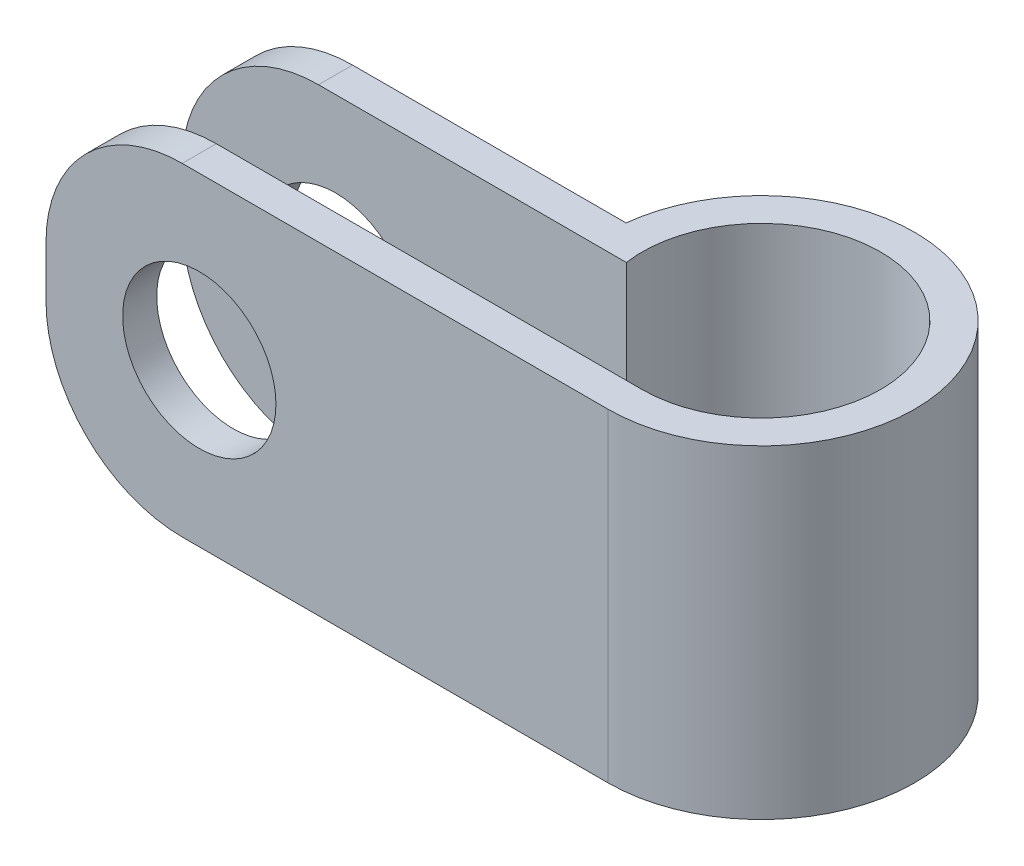
ISO-10303-21;
HEADER;
FILE_DESCRIPTION(('STEP AP214'),'2;1');
FILE_NAME('part.step','',(''),(''),'','','');
FILE_SCHEMA(('AUTOMOTIVE_DESIGN { 1 0 10303 214 1 1 1 1 }'));
ENDSEC;
DATA;
#1=APPLICATION_CONTEXT('core data for automotive mechanical design processes');
#2=APPLICATION_PROTOCOL_DEFINITION('international standard','automotive_design',2000,#1);
#3=PRODUCT_CONTEXT('',#1,'mechanical');
#4=PRODUCT('Part','Part','',(#3));
#5=PRODUCT_RELATED_PRODUCT_CATEGORY('part','',(#4));
#6=PRODUCT_DEFINITION_FORMATION('','',#4);
#7=PRODUCT_DEFINITION_CONTEXT('part definition',#1,'design');
#8=PRODUCT_DEFINITION('design','',#6,#7);
#9=PRODUCT_DEFINITION_SHAPE('','',#8);
#10=(LENGTH_UNIT() NAMED_UNIT(*) SI_UNIT(.MILLI.,.METRE.));
#11=(NAMED_UNIT(*) PLANE_ANGLE_UNIT() SI_UNIT($,.RADIAN.));
#12=(NAMED_UNIT(*) SI_UNIT($,.STERADIAN.) SOLID_ANGLE_UNIT());
#13=UNCERTAINTY_MEASURE_WITH_UNIT(LENGTH_MEASURE(1.E-05),#10,'distance_accuracy_value','');
#14=(GEOMETRIC_REPRESENTATION_CONTEXT(3) GLOBAL_UNCERTAINTY_ASSIGNED_CONTEXT((#13)) GLOBAL_UNIT_ASSIGNED_CONTEXT((#10,
#11,#12)) REPRESENTATION_CONTEXT('',''));
#15=CARTESIAN_POINT('',(0.,0.,0.));
#16=DIRECTION('',(0.,0.,1.));
#17=DIRECTION('',(1.,0.,0.));
#18=AXIS2_PLACEMENT_3D('',#15,#16,#17);
#19=CARTESIAN_POINT('',(0.,4.75,0.));
#20=DIRECTION('',(0.,-1.,0.));
#21=DIRECTION('',(0.,0.,-1.));
#22=AXIS2_PLACEMENT_3D('',#19,#20,#21);
#23=CYLINDRICAL_SURFACE('',#22,3.5);
#24=CARTESIAN_POINT('',(0.,-4.75,0.));
#25=DIRECTION('',(0.,-1.,0.));
#26=DIRECTION('',(0.,0.,-1.));
#27=AXIS2_PLACEMENT_3D('',#24,#25,#26);
#28=CIRCLE('',#27,3.5);
#29=CARTESIAN_POINT('',(-3.46410161513775,-4.75,0.5));
#30=VERTEX_POINT('',#29);
#31=CARTESIAN_POINT('',(0.,-4.75,3.5));
#32=VERTEX_POINT('',#31);
#33=EDGE_CURVE('E146',#30,#32,#28,.T.);
#34=ORIENTED_EDGE('',*,*,#33,.T.);
#35=DIRECTION('',(0.,-1.,0.));
#36=VECTOR('',#35,1.);
#37=CARTESIAN_POINT('',(0.,4.75,3.5));
#38=LINE('',#37,#36);
#39=CARTESIAN_POINT('',(0.,4.75,3.5));
#40=VERTEX_POINT('',#39);
#41=EDGE_CURVE('E125',#40,#32,#38,.T.);
#42=ORIENTED_EDGE('',*,*,#41,.F.);
#43=CARTESIAN_POINT('',(0.,4.75,0.));
#44=DIRECTION('',(0.,-1.,0.));
#45=DIRECTION('',(0.,0.,-1.));
#46=AXIS2_PLACEMENT_3D('',#43,#44,#45);
#47=CIRCLE('',#46,3.5);
#48=CARTESIAN_POINT('',(-3.46410161513775,4.75,0.5));
#49=VERTEX_POINT('',#48);
#50=EDGE_CURVE('E132',#49,#40,#47,.T.);
#51=ORIENTED_EDGE('',*,*,#50,.F.);
#52=DIRECTION('',(0.,-1.,0.));
#53=VECTOR('',#52,1.);
#54=CARTESIAN_POINT('',(-3.46410161513775,4.75,0.5));
#55=LINE('',#54,#53);
#56=EDGE_CURVE('E217',#49,#30,#55,.T.);
#57=ORIENTED_EDGE('',*,*,#56,.T.);
#58=EDGE_LOOP('',(#34,#42,#51,#57));
#59=FACE_BOUND('',#58,.T.);
#60=ADVANCED_FACE('F33',(#59),#23,.F.);
#61=CARTESIAN_POINT('',(0.,4.75,3.5));
#62=DIRECTION('',(0.,0.,1.));
#63=DIRECTION('',(1.,0.,0.));
#64=AXIS2_PLACEMENT_3D('',#61,#62,#63);
#65=PLANE('',#64);
#66=CARTESIAN_POINT('',(-12.,0.,3.5));
#67=DIRECTION('',(0.,0.,1.));
#68=DIRECTION('',(1.,0.,0.));
#69=AXIS2_PLACEMENT_3D('',#66,#67,#68);
#70=CIRCLE('',#69,2.25);
#71=CARTESIAN_POINT('',(-9.75,0.,3.5));
#72=VERTEX_POINT('',#71);
#73=EDGE_CURVE('E219',#72,#72,#70,.T.);
#74=ORIENTED_EDGE('',*,*,#73,.T.);
#75=EDGE_LOOP('',(#74));
#76=FACE_BOUND('',#75,.T.);
#77=DIRECTION('',(-1.,0.,0.));
#78=VECTOR('',#77,1.);
#79=CARTESIAN_POINT('',(0.,-4.75,3.5));
#80=LINE('',#79,#78);
#81=CARTESIAN_POINT('',(-12.5,-4.75,3.5));
#82=VERTEX_POINT('',#81);
#83=EDGE_CURVE('E202',#32,#82,#80,.T.);
#84=ORIENTED_EDGE('',*,*,#83,.T.);
#85=CARTESIAN_POINT('',(-12.5,-0.75,3.5));
#86=DIRECTION('',(0.,0.,1.));
#87=DIRECTION('',(1.,0.,0.));
#88=AXIS2_PLACEMENT_3D('',#85,#86,#87);
#89=CIRCLE('',#88,4.);
#90=CARTESIAN_POINT('',(-16.5,-0.75,3.5));
#91=VERTEX_POINT('',#90);
#92=EDGE_CURVE('E11',#82,#91,#89,.F.);
#93=ORIENTED_EDGE('',*,*,#92,.T.);
#94=DIRECTION('',(0.,-1.,0.));
#95=VECTOR('',#94,1.);
#96=CARTESIAN_POINT('',(-16.5,4.75,3.5));
#97=LINE('',#96,#95);
#98=CARTESIAN_POINT('',(-16.5,0.75,3.5));
#99=VERTEX_POINT('',#98);
#100=EDGE_CURVE('E148',#99,#91,#97,.T.);
#101=ORIENTED_EDGE('',*,*,#100,.F.);
#102=CARTESIAN_POINT('',(-12.5,0.75,3.5));
#103=DIRECTION('',(0.,0.,1.));
#104=DIRECTION('',(1.,0.,0.));
#105=AXIS2_PLACEMENT_3D('',#102,#103,#104);
#106=CIRCLE('',#105,4.);
#107=CARTESIAN_POINT('',(-12.5,4.75,3.5));
#108=VERTEX_POINT('',#107);
#109=EDGE_CURVE('E41',#99,#108,#106,.F.);
#110=ORIENTED_EDGE('',*,*,#109,.T.);
#111=DIRECTION('',(-1.,0.,0.));
#112=VECTOR('',#111,1.);
#113=CARTESIAN_POINT('',(0.,4.75,3.5));
#114=LINE('',#113,#112);
#115=EDGE_CURVE('E121',#40,#108,#114,.T.);
#116=ORIENTED_EDGE('',*,*,#115,.F.);
#117=ORIENTED_EDGE('',*,*,#41,.T.);
#118=EDGE_LOOP('',(#84,#93,#101,#110,#116,#117));
#119=FACE_BOUND('',#118,.T.);
#120=ADVANCED_FACE('F123',(#76,#119),#65,.F.);
#121=CARTESIAN_POINT('',(-16.5,4.75,3.5));
#122=DIRECTION('',(1.,0.,0.));
#123=DIRECTION('',(0.,0.,-1.));
#124=AXIS2_PLACEMENT_3D('',#121,#122,#123);
#125=PLANE('',#124);
#126=ORIENTED_EDGE('',*,*,#100,.T.);
#127=DIRECTION('',(0.,0.,1.));
#128=VECTOR('',#127,1.);
#129=CARTESIAN_POINT('',(-16.5,-0.75,4.5));
#130=LINE('',#129,#128);
#131=CARTESIAN_POINT('',(-16.5,-0.75,4.5));
#132=VERTEX_POINT('',#131);
#133=EDGE_CURVE('E180',#91,#132,#130,.T.);
#134=ORIENTED_EDGE('',*,*,#133,.T.);
#135=DIRECTION('',(0.,-1.,0.));
#136=VECTOR('',#135,1.);
#137=CARTESIAN_POINT('',(-16.5,4.75,4.5));
#138=LINE('',#137,#136);
#139=CARTESIAN_POINT('',(-16.5,0.75,4.5));
#140=VERTEX_POINT('',#139);
#141=EDGE_CURVE('E152',#140,#132,#138,.T.);
#142=ORIENTED_EDGE('',*,*,#141,.F.);
#143=DIRECTION('',(0.,0.,1.));
#144=VECTOR('',#143,1.);
#145=CARTESIAN_POINT('',(-16.5,0.75,3.5));
#146=LINE('',#145,#144);
#147=EDGE_CURVE('E53',#140,#99,#146,.F.);
#148=ORIENTED_EDGE('',*,*,#147,.T.);
#149=EDGE_LOOP('',(#126,#134,#142,#148));
#150=FACE_BOUND('',#149,.T.);
#151=ADVANCED_FACE('F205',(#150),#125,.F.);
#152=CARTESIAN_POINT('',(-16.5,4.75,4.5));
#153=DIRECTION('',(0.,0.,-1.));
#154=DIRECTION('',(-1.,0.,0.));
#155=AXIS2_PLACEMENT_3D('',#152,#153,#154);
#156=PLANE('',#155);
#157=CARTESIAN_POINT('',(-12.,0.,4.5));
#158=DIRECTION('',(0.,0.,1.));
#159=DIRECTION('',(1.,0.,0.));
#160=AXIS2_PLACEMENT_3D('',#157,#158,#159);
#161=CIRCLE('',#160,2.25);
#162=CARTESIAN_POINT('',(-9.75,0.,4.5));
#163=VERTEX_POINT('',#162);
#164=EDGE_CURVE('E159',#163,#163,#161,.T.);
#165=ORIENTED_EDGE('',*,*,#164,.F.);
#166=EDGE_LOOP('',(#165));
#167=FACE_BOUND('',#166,.T.);
#168=ORIENTED_EDGE('',*,*,#141,.T.);
#169=CARTESIAN_POINT('',(-12.5,-0.75,4.5));
#170=DIRECTION('',(0.,0.,-1.));
#171=DIRECTION('',(-1.,0.,0.));
#172=AXIS2_PLACEMENT_3D('',#169,#170,#171);
#173=CIRCLE('',#172,4.);
#174=CARTESIAN_POINT('',(-12.5,-4.75,4.5));
#175=VERTEX_POINT('',#174);
#176=EDGE_CURVE('E185',#132,#175,#173,.F.);
#177=ORIENTED_EDGE('',*,*,#176,.T.);
#178=DIRECTION('',(1.,0.,0.));
#179=VECTOR('',#178,1.);
#180=CARTESIAN_POINT('',(-16.5,-4.75,4.5));
#181=LINE('',#180,#179);
#182=CARTESIAN_POINT('',(0.,-4.75,4.5));
#183=VERTEX_POINT('',#182);
#184=EDGE_CURVE('E191',#175,#183,#181,.T.);
#185=ORIENTED_EDGE('',*,*,#184,.T.);
#186=DIRECTION('',(0.,-1.,0.));
#187=VECTOR('',#186,1.);
#188=CARTESIAN_POINT('',(0.,4.75,4.5));
#189=LINE('',#188,#187);
#190=CARTESIAN_POINT('',(0.,4.75,4.5));
#191=VERTEX_POINT('',#190);
#192=EDGE_CURVE('E208',#191,#183,#189,.T.);
#193=ORIENTED_EDGE('',*,*,#192,.F.);
#194=DIRECTION('',(1.,0.,0.));
#195=VECTOR('',#194,1.);
#196=CARTESIAN_POINT('',(-16.5,4.75,4.5));
#197=LINE('',#196,#195);
#198=CARTESIAN_POINT('',(-12.5,4.75,4.5));
#199=VERTEX_POINT('',#198);
#200=EDGE_CURVE('E131',#199,#191,#197,.T.);
#201=ORIENTED_EDGE('',*,*,#200,.F.);
#202=CARTESIAN_POINT('',(-12.5,0.75,4.5));
#203=DIRECTION('',(0.,0.,-1.));
#204=DIRECTION('',(-1.,0.,0.));
#205=AXIS2_PLACEMENT_3D('',#202,#203,#204);
#206=CIRCLE('',#205,4.);
#207=EDGE_CURVE('E183',#199,#140,#206,.F.);
#208=ORIENTED_EDGE('',*,*,#207,.T.);
#209=EDGE_LOOP('',(#168,#177,#185,#193,#201,#208));
#210=FACE_BOUND('',#209,.T.);
#211=ADVANCED_FACE('F189',(#167,#210),#156,.F.);
#212=CARTESIAN_POINT('',(0.,4.75,0.));
#213=DIRECTION('',(0.,-1.,0.));
#214=DIRECTION('',(0.,0.,-1.));
#215=AXIS2_PLACEMENT_3D('',#212,#213,#214);
#216=CYLINDRICAL_SURFACE('',#215,4.5);
#217=CARTESIAN_POINT('',(0.,-4.75,0.));
#218=DIRECTION('',(0.,1.,0.));
#219=DIRECTION('',(0.,0.,1.));
#220=AXIS2_PLACEMENT_3D('',#217,#218,#219);
#221=CIRCLE('',#220,4.5);
#222=CARTESIAN_POINT('',(-4.47213595499958,-4.75,-0.499999999999998));
#223=VERTEX_POINT('',#222);
#224=EDGE_CURVE('E201',#183,#223,#221,.T.);
#225=ORIENTED_EDGE('',*,*,#224,.T.);
#226=DIRECTION('',(0.,-1.,0.));
#227=VECTOR('',#226,1.);
#228=CARTESIAN_POINT('',(-4.47213595499958,4.75,-0.499999999999998));
#229=LINE('',#228,#227);
#230=CARTESIAN_POINT('',(-4.47213595499958,4.75,-0.499999999999998));
#231=VERTEX_POINT('',#230);
#232=EDGE_CURVE('E233',#231,#223,#229,.T.);
#233=ORIENTED_EDGE('',*,*,#232,.F.);
#234=CARTESIAN_POINT('',(0.,4.75,0.));
#235=DIRECTION('',(0.,1.,0.));
#236=DIRECTION('',(0.,0.,1.));
#237=AXIS2_PLACEMENT_3D('',#234,#235,#236);
#238=CIRCLE('',#237,4.5);
#239=EDGE_CURVE('E210',#191,#231,#238,.T.);
#240=ORIENTED_EDGE('',*,*,#239,.F.);
#241=ORIENTED_EDGE('',*,*,#192,.T.);
#242=EDGE_LOOP('',(#225,#233,#240,#241));
#243=FACE_BOUND('',#242,.T.);
#244=ADVANCED_FACE('F237',(#243),#216,.T.);
#245=CARTESIAN_POINT('',(-16.5,4.75,-0.499999999999998));
#246=DIRECTION('',(0.,0.,1.));
#247=DIRECTION('',(1.,0.,0.));
#248=AXIS2_PLACEMENT_3D('',#245,#246,#247);
#249=PLANE('',#248);
#250=CARTESIAN_POINT('',(-12.,0.,-0.499999999999998));
#251=DIRECTION('',(0.,0.,1.));
#252=DIRECTION('',(1.,0.,0.));
#253=AXIS2_PLACEMENT_3D('',#250,#251,#252);
#254=CIRCLE('',#253,2.25);
#255=CARTESIAN_POINT('',(-9.75,0.,-0.499999999999998));
#256=VERTEX_POINT('',#255);
#257=EDGE_CURVE('E158',#256,#256,#254,.T.);
#258=ORIENTED_EDGE('',*,*,#257,.T.);
#259=EDGE_LOOP('',(#258));
#260=FACE_BOUND('',#259,.T.);
#261=DIRECTION('',(-1.,0.,0.));
#262=VECTOR('',#261,1.);
#263=CARTESIAN_POINT('',(-16.5,-4.75,-0.499999999999998));
#264=LINE('',#263,#262);
#265=CARTESIAN_POINT('',(-12.5,-4.75,-0.499999999999998));
#266=VERTEX_POINT('',#265);
#267=EDGE_CURVE('E222',#223,#266,#264,.T.);
#268=ORIENTED_EDGE('',*,*,#267,.T.);
#269=CARTESIAN_POINT('',(-12.5,-0.75,-0.499999999999998));
#270=DIRECTION('',(0.,0.,1.));
#271=DIRECTION('',(1.,0.,0.));
#272=AXIS2_PLACEMENT_3D('',#269,#270,#271);
#273=CIRCLE('',#272,4.);
#274=CARTESIAN_POINT('',(-16.5,-0.75,-0.499999999999998));
#275=VERTEX_POINT('',#274);
#276=EDGE_CURVE('E173',#266,#275,#273,.F.);
#277=ORIENTED_EDGE('',*,*,#276,.T.);
#278=DIRECTION('',(0.,-1.,0.));
#279=VECTOR('',#278,1.);
#280=CARTESIAN_POINT('',(-16.5,4.75,-0.499999999999998));
#281=LINE('',#280,#279);
#282=CARTESIAN_POINT('',(-16.5,0.75,-0.499999999999998));
#283=VERTEX_POINT('',#282);
#284=EDGE_CURVE('E230',#283,#275,#281,.T.);
#285=ORIENTED_EDGE('',*,*,#284,.F.);
#286=CARTESIAN_POINT('',(-12.5,0.75,-0.499999999999998));
#287=DIRECTION('',(0.,0.,1.));
#288=DIRECTION('',(1.,0.,0.));
#289=AXIS2_PLACEMENT_3D('',#286,#287,#288);
#290=CIRCLE('',#289,4.);
#291=CARTESIAN_POINT('',(-12.5,4.75,-0.499999999999998));
#292=VERTEX_POINT('',#291);
#293=EDGE_CURVE('E171',#283,#292,#290,.F.);
#294=ORIENTED_EDGE('',*,*,#293,.T.);
#295=DIRECTION('',(-1.,0.,0.));
#296=VECTOR('',#295,1.);
#297=CARTESIAN_POINT('',(-16.5,4.75,-0.499999999999998));
#298=LINE('',#297,#296);
#299=EDGE_CURVE('E212',#231,#292,#298,.T.);
#300=ORIENTED_EDGE('',*,*,#299,.F.);
#301=ORIENTED_EDGE('',*,*,#232,.T.);
#302=EDGE_LOOP('',(#268,#277,#285,#294,#300,#301));
#303=FACE_BOUND('',#302,.T.);
#304=ADVANCED_FACE('F257',(#260,#303),#249,.F.);
#305=CARTESIAN_POINT('',(-16.5,4.75,0.500000000000002));
#306=DIRECTION('',(1.,0.,0.));
#307=DIRECTION('',(0.,0.,-1.));
#308=AXIS2_PLACEMENT_3D('',#305,#306,#307);
#309=PLANE('',#308);
#310=ORIENTED_EDGE('',*,*,#284,.T.);
#311=DIRECTION('',(0.,0.,1.));
#312=VECTOR('',#311,1.);
#313=CARTESIAN_POINT('',(-16.5,-0.75,0.500000000000002));
#314=LINE('',#313,#312);
#315=CARTESIAN_POINT('',(-16.5,-0.75,0.500000000000002));
#316=VERTEX_POINT('',#315);
#317=EDGE_CURVE('E150',#275,#316,#314,.T.);
#318=ORIENTED_EDGE('',*,*,#317,.T.);
#319=DIRECTION('',(0.,-1.,0.));
#320=VECTOR('',#319,1.);
#321=CARTESIAN_POINT('',(-16.5,4.75,0.500000000000002));
#322=LINE('',#321,#320);
#323=CARTESIAN_POINT('',(-16.5,0.75,0.500000000000002));
#324=VERTEX_POINT('',#323);
#325=EDGE_CURVE('E227',#324,#316,#322,.T.);
#326=ORIENTED_EDGE('',*,*,#325,.F.);
#327=DIRECTION('',(0.,0.,1.));
#328=VECTOR('',#327,1.);
#329=CARTESIAN_POINT('',(-16.5,0.75,0.500000000000002));
#330=LINE('',#329,#328);
#331=EDGE_CURVE('E147',#324,#283,#330,.F.);
#332=ORIENTED_EDGE('',*,*,#331,.T.);
#333=EDGE_LOOP('',(#310,#318,#326,#332));
#334=FACE_BOUND('',#333,.T.);
#335=ADVANCED_FACE('F250',(#334),#309,.F.);
#336=CARTESIAN_POINT('',(-3.46410161513775,4.75,0.5));
#337=DIRECTION('',(0.,0.,-1.));
#338=DIRECTION('',(-1.,0.,0.));
#339=AXIS2_PLACEMENT_3D('',#336,#337,#338);
#340=PLANE('',#339);
#341=CARTESIAN_POINT('',(-12.,0.,0.500000000000001));
#342=DIRECTION('',(0.,0.,-1.));
#343=DIRECTION('',(-1.,0.,0.));
#344=AXIS2_PLACEMENT_3D('',#341,#342,#343);
#345=CIRCLE('',#344,2.25);
#346=CARTESIAN_POINT('',(-14.25,0.,0.500000000000002));
#347=VERTEX_POINT('',#346);
#348=EDGE_CURVE('E156',#347,#347,#345,.T.);
#349=ORIENTED_EDGE('',*,*,#348,.T.);
#350=EDGE_LOOP('',(#349));
#351=FACE_BOUND('',#350,.T.);
#352=ORIENTED_EDGE('',*,*,#325,.T.);
#353=CARTESIAN_POINT('',(-12.5,-0.75,0.500000000000002));
#354=DIRECTION('',(0.,0.,-1.));
#355=DIRECTION('',(-1.,0.,0.));
#356=AXIS2_PLACEMENT_3D('',#353,#354,#355);
#357=CIRCLE('',#356,4.);
#358=CARTESIAN_POINT('',(-12.5,-4.75,0.500000000000002));
#359=VERTEX_POINT('',#358);
#360=EDGE_CURVE('E165',#316,#359,#357,.F.);
#361=ORIENTED_EDGE('',*,*,#360,.T.);
#362=DIRECTION('',(1.,0.,0.));
#363=VECTOR('',#362,1.);
#364=CARTESIAN_POINT('',(-3.46410161513775,-4.75,0.5));
#365=LINE('',#364,#363);
#366=EDGE_CURVE('E143',#359,#30,#365,.T.);
#367=ORIENTED_EDGE('',*,*,#366,.T.);
#368=ORIENTED_EDGE('',*,*,#56,.F.);
#369=DIRECTION('',(1.,0.,0.));
#370=VECTOR('',#369,1.);
#371=CARTESIAN_POINT('',(-3.46410161513775,4.75,0.5));
#372=LINE('',#371,#370);
#373=CARTESIAN_POINT('',(-12.5,4.75,0.500000000000002));
#374=VERTEX_POINT('',#373);
#375=EDGE_CURVE('E139',#374,#49,#372,.T.);
#376=ORIENTED_EDGE('',*,*,#375,.F.);
#377=CARTESIAN_POINT('',(-12.5,0.75,0.500000000000002));
#378=DIRECTION('',(0.,0.,-1.));
#379=DIRECTION('',(-1.,0.,0.));
#380=AXIS2_PLACEMENT_3D('',#377,#378,#379);
#381=CIRCLE('',#380,4.);
#382=EDGE_CURVE('E163',#374,#324,#381,.F.);
#383=ORIENTED_EDGE('',*,*,#382,.T.);
#384=EDGE_LOOP('',(#352,#361,#367,#368,#376,#383));
#385=FACE_BOUND('',#384,.T.);
#386=ADVANCED_FACE('F248',(#351,#385),#340,.F.);
#387=CARTESIAN_POINT('',(0.,4.75,0.));
#388=DIRECTION('',(0.,-1.,0.));
#389=DIRECTION('',(0.,0.,-1.));
#390=AXIS2_PLACEMENT_3D('',#387,#388,#389);
#391=PLANE('',#390);
#392=ORIENTED_EDGE('',*,*,#299,.T.);
#393=DIRECTION('',(0.,0.,1.));
#394=VECTOR('',#393,1.);
#395=CARTESIAN_POINT('',(-12.5,4.75,0.));
#396=LINE('',#395,#394);
#397=EDGE_CURVE('E177',#292,#374,#396,.T.);
#398=ORIENTED_EDGE('',*,*,#397,.T.);
#399=ORIENTED_EDGE('',*,*,#375,.T.);
#400=ORIENTED_EDGE('',*,*,#50,.T.);
#401=ORIENTED_EDGE('',*,*,#115,.T.);
#402=DIRECTION('',(0.,0.,1.));
#403=VECTOR('',#402,1.);
#404=CARTESIAN_POINT('',(-12.5,4.75,0.));
#405=LINE('',#404,#403);
#406=EDGE_CURVE('E175',#108,#199,#405,.T.);
#407=ORIENTED_EDGE('',*,*,#406,.T.);
#408=ORIENTED_EDGE('',*,*,#200,.T.);
#409=ORIENTED_EDGE('',*,*,#239,.T.);
#410=EDGE_LOOP('',(#392,#398,#399,#400,#401,#407,#408,#409));
#411=FACE_BOUND('',#410,.T.);
#412=ADVANCED_FACE('F136',(#411),#391,.F.);
#413=CARTESIAN_POINT('',(0.,-4.75,0.));
#414=DIRECTION('',(0.,-1.,0.));
#415=DIRECTION('',(0.,0.,-1.));
#416=AXIS2_PLACEMENT_3D('',#413,#414,#415);
#417=PLANE('',#416);
#418=ORIENTED_EDGE('',*,*,#366,.F.);
#419=DIRECTION('',(0.,0.,1.));
#420=VECTOR('',#419,1.);
#421=CARTESIAN_POINT('',(-12.5,-4.75,-0.499999999999998));
#422=LINE('',#421,#420);
#423=EDGE_CURVE('E169',#359,#266,#422,.F.);
#424=ORIENTED_EDGE('',*,*,#423,.T.);
#425=ORIENTED_EDGE('',*,*,#267,.F.);
#426=ORIENTED_EDGE('',*,*,#224,.F.);
#427=ORIENTED_EDGE('',*,*,#184,.F.);
#428=DIRECTION('',(0.,0.,1.));
#429=VECTOR('',#428,1.);
#430=CARTESIAN_POINT('',(-12.5,-4.75,3.5));
#431=LINE('',#430,#429);
#432=EDGE_CURVE('E167',#175,#82,#431,.F.);
#433=ORIENTED_EDGE('',*,*,#432,.T.);
#434=ORIENTED_EDGE('',*,*,#83,.F.);
#435=ORIENTED_EDGE('',*,*,#33,.F.);
#436=EDGE_LOOP('',(#418,#424,#425,#426,#427,#433,#434,#435));
#437=FACE_BOUND('',#436,.T.);
#438=ADVANCED_FACE('F199',(#437),#417,.T.);
#439=CARTESIAN_POINT('',(-12.,0.,-4.5));
#440=DIRECTION('',(0.,0.,1.));
#441=DIRECTION('',(1.,0.,0.));
#442=AXIS2_PLACEMENT_3D('',#439,#440,#441);
#443=CYLINDRICAL_SURFACE('',#442,2.25);
#444=ORIENTED_EDGE('',*,*,#348,.F.);
#445=EDGE_LOOP('',(#444));
#446=FACE_BOUND('',#445,.T.);
#447=ORIENTED_EDGE('',*,*,#257,.F.);
#448=EDGE_LOOP('',(#447));
#449=FACE_BOUND('',#448,.T.);
#450=ADVANCED_FACE('F314',(#446,#449),#443,.F.);
#451=ORIENTED_EDGE('',*,*,#164,.T.);
#452=EDGE_LOOP('',(#451));
#453=FACE_BOUND('',#452,.T.);
#454=ORIENTED_EDGE('',*,*,#73,.F.);
#455=EDGE_LOOP('',(#454));
#456=FACE_BOUND('',#455,.T.);
#457=ADVANCED_FACE('F279',(#453,#456),#443,.F.);
#458=CARTESIAN_POINT('',(-12.5,-0.75,0.500000000000002));
#459=DIRECTION('',(0.,0.,-1.));
#460=DIRECTION('',(-1.,0.,0.));
#461=AXIS2_PLACEMENT_3D('',#458,#459,#460);
#462=CYLINDRICAL_SURFACE('',#461,4.);
#463=ORIENTED_EDGE('',*,*,#276,.F.);
#464=ORIENTED_EDGE('',*,*,#423,.F.);
#465=ORIENTED_EDGE('',*,*,#360,.F.);
#466=ORIENTED_EDGE('',*,*,#317,.F.);
#467=EDGE_LOOP('',(#463,#464,#465,#466));
#468=FACE_BOUND('',#467,.T.);
#469=ADVANCED_FACE('F255',(#468),#462,.T.);
#470=CARTESIAN_POINT('',(-12.5,0.75,0.));
#471=DIRECTION('',(0.,0.,1.));
#472=DIRECTION('',(1.,0.,0.));
#473=AXIS2_PLACEMENT_3D('',#470,#471,#472);
#474=CYLINDRICAL_SURFACE('',#473,4.);
#475=ORIENTED_EDGE('',*,*,#293,.F.);
#476=ORIENTED_EDGE('',*,*,#331,.F.);
#477=ORIENTED_EDGE('',*,*,#382,.F.);
#478=ORIENTED_EDGE('',*,*,#397,.F.);
#479=EDGE_LOOP('',(#475,#476,#477,#478));
#480=FACE_BOUND('',#479,.T.);
#481=ADVANCED_FACE('F244',(#480),#474,.T.);
#482=CARTESIAN_POINT('',(-12.5,-0.75,3.5));
#483=DIRECTION('',(0.,0.,-1.));
#484=DIRECTION('',(-1.,0.,0.));
#485=AXIS2_PLACEMENT_3D('',#482,#483,#484);
#486=CYLINDRICAL_SURFACE('',#485,4.);
#487=ORIENTED_EDGE('',*,*,#92,.F.);
#488=ORIENTED_EDGE('',*,*,#432,.F.);
#489=ORIENTED_EDGE('',*,*,#176,.F.);
#490=ORIENTED_EDGE('',*,*,#133,.F.);
#491=EDGE_LOOP('',(#487,#488,#489,#490));
#492=FACE_BOUND('',#491,.T.);
#493=ADVANCED_FACE('F204',(#492),#486,.T.);
#494=CARTESIAN_POINT('',(-12.5,0.75,0.));
#495=DIRECTION('',(0.,0.,1.));
#496=DIRECTION('',(1.,0.,0.));
#497=AXIS2_PLACEMENT_3D('',#494,#495,#496);
#498=CYLINDRICAL_SURFACE('',#497,4.);
#499=ORIENTED_EDGE('',*,*,#109,.F.);
#500=ORIENTED_EDGE('',*,*,#147,.F.);
#501=ORIENTED_EDGE('',*,*,#207,.F.);
#502=ORIENTED_EDGE('',*,*,#406,.F.);
#503=EDGE_LOOP('',(#499,#500,#501,#502));
#504=FACE_BOUND('',#503,.T.);
#505=ADVANCED_FACE('F35',(#504),#498,.T.);
#506=CLOSED_SHELL('',(#60,#120,#151,#211,#244,#304,#335,#386,#412,#438,#450,#457,#469,#481,#493,#505));
#507=MANIFOLD_SOLID_BREP('B2',#506);
#508=ADVANCED_BREP_SHAPE_REPRESENTATION('',(#18,#507),#14);
#509=SHAPE_DEFINITION_REPRESENTATION(#9,#508);
ENDSEC;
END-ISO-10303-21;
